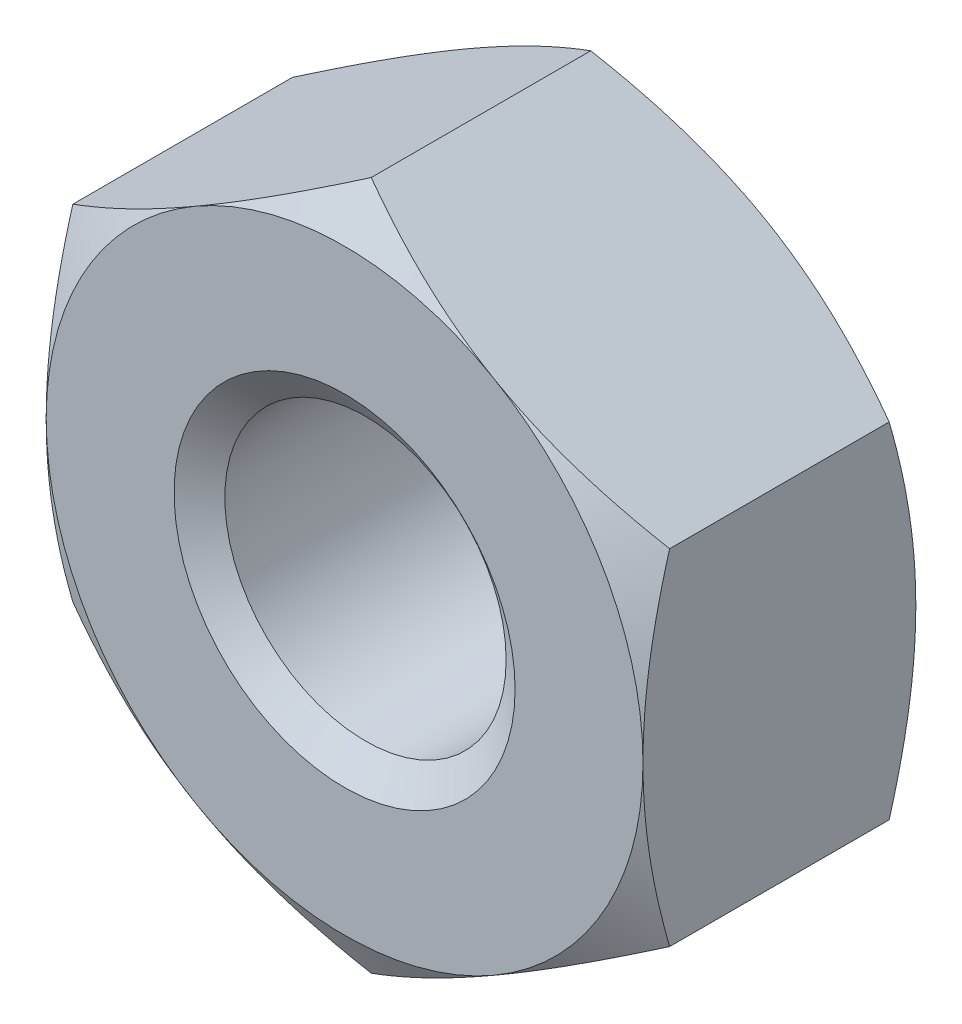
ISO-10303-21;
HEADER;
FILE_DESCRIPTION(('STEP AP214'),'2;1');
FILE_NAME('part.step','',(''),(''),'','','');
FILE_SCHEMA(('AUTOMOTIVE_DESIGN { 1 0 10303 214 1 1 1 1 }'));
ENDSEC;
DATA;
#1=APPLICATION_CONTEXT('core data for automotive mechanical design processes');
#2=APPLICATION_PROTOCOL_DEFINITION('international standard','automotive_design',2000,#1);
#3=PRODUCT_CONTEXT('',#1,'mechanical');
#4=PRODUCT('Part','Part','',(#3));
#5=PRODUCT_RELATED_PRODUCT_CATEGORY('part','',(#4));
#6=PRODUCT_DEFINITION_FORMATION('','',#4);
#7=PRODUCT_DEFINITION_CONTEXT('part definition',#1,'design');
#8=PRODUCT_DEFINITION('design','',#6,#7);
#9=PRODUCT_DEFINITION_SHAPE('','',#8);
#10=(LENGTH_UNIT() NAMED_UNIT(*) SI_UNIT(.MILLI.,.METRE.));
#11=(NAMED_UNIT(*) PLANE_ANGLE_UNIT() SI_UNIT($,.RADIAN.));
#12=(NAMED_UNIT(*) SI_UNIT($,.STERADIAN.) SOLID_ANGLE_UNIT());
#13=UNCERTAINTY_MEASURE_WITH_UNIT(LENGTH_MEASURE(1.E-05),#10,'distance_accuracy_value','');
#14=(GEOMETRIC_REPRESENTATION_CONTEXT(3) GLOBAL_UNCERTAINTY_ASSIGNED_CONTEXT((#13)) GLOBAL_UNIT_ASSIGNED_CONTEXT((#10,
#11,#12)) REPRESENTATION_CONTEXT('',''));
#15=CARTESIAN_POINT('',(0.,0.,0.));
#16=DIRECTION('',(0.,0.,1.));
#17=DIRECTION('',(1.,0.,0.));
#18=AXIS2_PLACEMENT_3D('',#15,#16,#17);
#19=CARTESIAN_POINT('',(0.,0.,-3.2));
#20=DIRECTION('',(0.,0.,1.));
#21=DIRECTION('',(1.,0.,0.));
#22=AXIS2_PLACEMENT_3D('',#19,#20,#21);
#23=CYLINDRICAL_SURFACE('',#22,1.65);
#24=CARTESIAN_POINT('',(0.,0.,-0.245072638373399));
#25=DIRECTION('',(0.,0.,1.));
#26=DIRECTION('',(1.,0.,0.));
#27=AXIS2_PLACEMENT_3D('',#24,#25,#26);
#28=CIRCLE('',#27,1.65);
#29=CARTESIAN_POINT('',(1.65,0.,-0.245072638373399));
#30=VERTEX_POINT('',#29);
#31=EDGE_CURVE('E185',#30,#30,#28,.F.);
#32=ORIENTED_EDGE('',*,*,#31,.F.);
#33=EDGE_LOOP('',(#32));
#34=FACE_BOUND('',#33,.T.);
#35=CARTESIAN_POINT('',(0.,0.,-2.9295273616266));
#36=DIRECTION('',(0.,0.,-1.));
#37=DIRECTION('',(-1.,0.,0.));
#38=AXIS2_PLACEMENT_3D('',#35,#36,#37);
#39=CIRCLE('',#38,1.65);
#40=CARTESIAN_POINT('',(-1.65,0.,-2.9295273616266));
#41=VERTEX_POINT('',#40);
#42=EDGE_CURVE('E44',#41,#41,#39,.F.);
#43=ORIENTED_EDGE('',*,*,#42,.F.);
#44=EDGE_LOOP('',(#43));
#45=FACE_BOUND('',#44,.T.);
#46=ADVANCED_FACE('F39',(#34,#45),#23,.F.);
#47=CARTESIAN_POINT('',(-6.99999999999999,0.,-3.2));
#48=DIRECTION('',(0.,0.,1.));
#49=DIRECTION('',(1.,0.,0.));
#50=AXIS2_PLACEMENT_3D('',#47,#48,#49);
#51=PLANE('',#50);
#52=CARTESIAN_POINT('',(0.,0.,-3.2));
#53=DIRECTION('',(0.,0.,1.));
#54=DIRECTION('',(1.,0.,0.));
#55=AXIS2_PLACEMENT_3D('',#52,#53,#54);
#56=CIRCLE('',#55,3.5);
#57=CARTESIAN_POINT('',(3.5,0.,-3.2));
#58=VERTEX_POINT('',#57);
#59=CARTESIAN_POINT('',(1.75,3.03108891324553,-3.2));
#60=VERTEX_POINT('',#59);
#61=EDGE_CURVE('E258',#58,#60,#56,.T.);
#62=ORIENTED_EDGE('',*,*,#61,.F.);
#63=CARTESIAN_POINT('',(0.,0.,-3.2));
#64=DIRECTION('',(0.,0.,1.));
#65=DIRECTION('',(1.,0.,0.));
#66=AXIS2_PLACEMENT_3D('',#63,#64,#65);
#67=CIRCLE('',#66,3.5);
#68=CARTESIAN_POINT('',(1.75,-3.03108891324553,-3.2));
#69=VERTEX_POINT('',#68);
#70=EDGE_CURVE('E179',#58,#69,#67,.F.);
#71=ORIENTED_EDGE('',*,*,#70,.T.);
#72=CARTESIAN_POINT('',(-1.75,-3.03108891324553,-3.2));
#73=VERTEX_POINT('',#72);
#74=EDGE_CURVE('E181',#69,#73,#67,.F.);
#75=ORIENTED_EDGE('',*,*,#74,.T.);
#76=CARTESIAN_POINT('',(-3.5,0.,-3.2));
#77=VERTEX_POINT('',#76);
#78=EDGE_CURVE('E417',#73,#77,#67,.F.);
#79=ORIENTED_EDGE('',*,*,#78,.T.);
#80=CARTESIAN_POINT('',(-1.75,3.03108891324553,-3.2));
#81=VERTEX_POINT('',#80);
#82=EDGE_CURVE('E419',#77,#81,#67,.F.);
#83=ORIENTED_EDGE('',*,*,#82,.T.);
#84=EDGE_CURVE('E163',#81,#60,#67,.F.);
#85=ORIENTED_EDGE('',*,*,#84,.T.);
#86=EDGE_LOOP('',(#62,#71,#75,#79,#83,#85));
#87=FACE_BOUND('',#86,.T.);
#88=CARTESIAN_POINT('',(0.,0.,-3.2));
#89=DIRECTION('',(0.,0.,1.));
#90=DIRECTION('',(1.,0.,0.));
#91=AXIS2_PLACEMENT_3D('',#88,#89,#90);
#92=CIRCLE('',#91,2.);
#93=CARTESIAN_POINT('',(2.,0.,-3.2));
#94=VERTEX_POINT('',#93);
#95=EDGE_CURVE('E189',#94,#94,#92,.F.);
#96=ORIENTED_EDGE('',*,*,#95,.F.);
#97=EDGE_LOOP('',(#96));
#98=FACE_BOUND('',#97,.T.);
#99=ADVANCED_FACE('F310',(#87,#98),#51,.F.);
#100=CARTESIAN_POINT('',(-6.99999999999999,0.,0.));
#101=DIRECTION('',(0.,0.,1.));
#102=DIRECTION('',(1.,0.,0.));
#103=AXIS2_PLACEMENT_3D('',#100,#101,#102);
#104=PLANE('',#103);
#105=CARTESIAN_POINT('',(0.,0.,0.));
#106=DIRECTION('',(0.,0.,1.));
#107=DIRECTION('',(1.,0.,0.));
#108=AXIS2_PLACEMENT_3D('',#105,#106,#107);
#109=CIRCLE('',#108,3.5);
#110=CARTESIAN_POINT('',(1.75,-3.03108891324553,0.));
#111=VERTEX_POINT('',#110);
#112=CARTESIAN_POINT('',(3.5,0.,0.));
#113=VERTEX_POINT('',#112);
#114=EDGE_CURVE('E52',#111,#113,#109,.T.);
#115=ORIENTED_EDGE('',*,*,#114,.T.);
#116=CARTESIAN_POINT('',(0.,0.,0.));
#117=DIRECTION('',(0.,0.,1.));
#118=DIRECTION('',(1.,0.,0.));
#119=AXIS2_PLACEMENT_3D('',#116,#117,#118);
#120=CIRCLE('',#119,3.5);
#121=CARTESIAN_POINT('',(1.75,3.03108891324553,0.));
#122=VERTEX_POINT('',#121);
#123=EDGE_CURVE('E59',#113,#122,#120,.T.);
#124=ORIENTED_EDGE('',*,*,#123,.T.);
#125=CARTESIAN_POINT('',(-1.75,3.03108891324553,0.));
#126=VERTEX_POINT('',#125);
#127=EDGE_CURVE('E11',#122,#126,#109,.T.);
#128=ORIENTED_EDGE('',*,*,#127,.T.);
#129=CARTESIAN_POINT('',(-3.5,0.,0.));
#130=VERTEX_POINT('',#129);
#131=EDGE_CURVE('E50',#126,#130,#109,.T.);
#132=ORIENTED_EDGE('',*,*,#131,.T.);
#133=CARTESIAN_POINT('',(-1.75,-3.03108891324553,0.));
#134=VERTEX_POINT('',#133);
#135=EDGE_CURVE('E361',#130,#134,#109,.T.);
#136=ORIENTED_EDGE('',*,*,#135,.T.);
#137=EDGE_CURVE('E184',#134,#111,#109,.T.);
#138=ORIENTED_EDGE('',*,*,#137,.T.);
#139=EDGE_LOOP('',(#115,#124,#128,#132,#136,#138));
#140=FACE_BOUND('',#139,.T.);
#141=CARTESIAN_POINT('',(0.,0.,0.));
#142=DIRECTION('',(0.,0.,1.));
#143=DIRECTION('',(1.,0.,0.));
#144=AXIS2_PLACEMENT_3D('',#141,#142,#143);
#145=CIRCLE('',#144,2.);
#146=CARTESIAN_POINT('',(2.,0.,0.));
#147=VERTEX_POINT('',#146);
#148=EDGE_CURVE('E188',#147,#147,#145,.T.);
#149=ORIENTED_EDGE('',*,*,#148,.F.);
#150=EDGE_LOOP('',(#149));
#151=FACE_BOUND('',#150,.T.);
#152=ADVANCED_FACE('F263',(#140,#151),#104,.T.);
#153=CARTESIAN_POINT('',(0.,4.04145188432738,-3.2));
#154=DIRECTION('',(-0.500000000000001,0.866025403784438,0.));
#155=DIRECTION('',(-0.866025403784438,-0.500000000000001,0.));
#156=AXIS2_PLACEMENT_3D('',#153,#154,#155);
#157=PLANE('',#156);
#158=DIRECTION('',(0.,0.,1.));
#159=VECTOR('',#158,1.);
#160=CARTESIAN_POINT('',(-3.5,2.02072594216369,-3.2));
#161=LINE('',#160,#159);
#162=CARTESIAN_POINT('',(-3.5,2.0207259421637,-2.88739260883035));
#163=VERTEX_POINT('',#162);
#164=CARTESIAN_POINT('',(-3.5,2.02072594216369,-0.312607391169644));
#165=VERTEX_POINT('',#164);
#166=EDGE_CURVE('E175',#163,#165,#161,.T.);
#167=ORIENTED_EDGE('',*,*,#166,.T.);
#168=CARTESIAN_POINT('',(-3.5002,2.02061047210985,-0.312674060693372));
#169=CARTESIAN_POINT('',(-3.34639282154755,2.10941108799267,-0.261385788989984));
#170=CARTESIAN_POINT('',(-3.19125798916558,2.19897822522909,-0.214740953816197));
#171=CARTESIAN_POINT('',(-2.87830199342322,2.37966345361545,-0.133321875533348));
#172=CARTESIAN_POINT('',(-2.7204752692125,2.47078475532382,-0.0985764355845611));
#173=CARTESIAN_POINT('',(-2.40677778961987,2.65189807961073,-0.0444900271828357));
#174=CARTESIAN_POINT('',(-2.25095530083931,2.74186223545399,-0.0247890862603813));
#175=CARTESIAN_POINT('',(-1.93857711279463,2.92221386641056,-0.00127013273725425));
#176=CARTESIAN_POINT('',(-1.78202254896577,3.01260068598001,0.00256735545443477));
#177=CARTESIAN_POINT('',(-1.48949078007901,3.1814939814933,-0.00541530187697793));
#178=CARTESIAN_POINT('',(-1.35346978754209,3.26002573814993,-0.0152754340696075));
#179=CARTESIAN_POINT('',(-1.08231397971101,3.41657761679354,-0.0465264668994044));
#180=CARTESIAN_POINT('',(-0.947180102315318,3.49459719728458,-0.0679280432857993));
#181=CARTESIAN_POINT('',(-0.675465207594817,3.65147186489429,-0.121430407880579));
#182=CARTESIAN_POINT('',(-0.538918580721665,3.73030709667644,-0.153757994445089));
#183=CARTESIAN_POINT('',(-0.267861907055499,3.88680174018324,-0.227128933807997));
#184=CARTESIAN_POINT('',(-0.133348387531464,3.96446315689009,-0.26815504656987));
#185=CARTESIAN_POINT('',(0.000199999999999316,4.04156735438122,-0.312674060693374));
#186=B_SPLINE_CURVE_WITH_KNOTS('',3,(#168,#169,#170,#171,#172,#173,#174,#175,#176,#177,#178,
#179,#180,#181,#182,#183,#184,#185),.UNSPECIFIED.,.F.,.F.,(4,2,2,2,2,2,2,2,4),(0.,
0.554793832886255,1.11092123814984,1.65328467083219,2.19498204478403,2.6666513085086,
3.13875761298267,3.6213361260051,4.10296698719187),.UNSPECIFIED.);
#187=EDGE_CURVE('E67',#165,#126,#186,.T.);
#188=ORIENTED_EDGE('',*,*,#187,.T.);
#189=CARTESIAN_POINT('',(0.,4.04145188432738,-0.312607391169646));
#190=VERTEX_POINT('',#189);
#191=EDGE_CURVE('E252',#126,#190,#186,.T.);
#192=ORIENTED_EDGE('',*,*,#191,.T.);
#193=DIRECTION('',(0.,0.,1.));
#194=VECTOR('',#193,1.);
#195=CARTESIAN_POINT('',(0.,4.04145188432738,-3.2));
#196=LINE('',#195,#194);
#197=CARTESIAN_POINT('',(0.,4.04145188432738,-2.88739260883035));
#198=VERTEX_POINT('',#197);
#199=EDGE_CURVE('E159',#198,#190,#196,.T.);
#200=ORIENTED_EDGE('',*,*,#199,.F.);
#201=CARTESIAN_POINT('',(-3.5002,2.02061047210985,-2.88732593930663));
#202=CARTESIAN_POINT('',(-3.34639282154755,2.10941108799267,-2.93861421101002));
#203=CARTESIAN_POINT('',(-3.19125798916558,2.19897822522909,-2.9852590461838));
#204=CARTESIAN_POINT('',(-2.87830199342322,2.37966345361545,-3.06667812446665));
#205=CARTESIAN_POINT('',(-2.7204752692125,2.47078475532382,-3.10142356441544));
#206=CARTESIAN_POINT('',(-2.40677778961987,2.65189807961073,-3.15550997281716));
#207=CARTESIAN_POINT('',(-2.25095530083931,2.74186223545399,-3.17521091373962));
#208=CARTESIAN_POINT('',(-1.93857711279463,2.92221386641056,-3.19872986726275));
#209=CARTESIAN_POINT('',(-1.78202254896577,3.01260068598001,-3.20256735545443));
#210=CARTESIAN_POINT('',(-1.48949078007901,3.1814939814933,-3.19458469812302));
#211=CARTESIAN_POINT('',(-1.35346978754209,3.26002573814993,-3.18472456593039));
#212=CARTESIAN_POINT('',(-1.08231397971101,3.41657761679354,-3.1534735331006));
#213=CARTESIAN_POINT('',(-0.947180102315318,3.49459719728458,-3.1320719567142));
#214=CARTESIAN_POINT('',(-0.675465207594817,3.65147186489429,-3.07856959211942));
#215=CARTESIAN_POINT('',(-0.538918580721665,3.73030709667644,-3.04624200555491));
#216=CARTESIAN_POINT('',(-0.267861907055499,3.88680174018324,-2.972871066192));
#217=CARTESIAN_POINT('',(-0.133348387531464,3.96446315689009,-2.93184495343013));
#218=CARTESIAN_POINT('',(0.000199999999999315,4.04156735438122,-2.88732593930663));
#219=B_SPLINE_CURVE_WITH_KNOTS('',3,(#201,#202,#203,#204,#205,#206,#207,#208,#209,#210,#211,
#212,#213,#214,#215,#216,#217,#218),.UNSPECIFIED.,.F.,.F.,(4,2,2,2,2,2,2,2,4),(0.,
0.554793832886255,1.11092123814984,1.65328467083219,2.19498204478403,2.6666513085086,
3.13875761298267,3.6213361260051,4.10296698719187),.UNSPECIFIED.);
#220=EDGE_CURVE('E178',#81,#198,#219,.T.);
#221=ORIENTED_EDGE('',*,*,#220,.F.);
#222=EDGE_CURVE('E273',#163,#81,#219,.T.);
#223=ORIENTED_EDGE('',*,*,#222,.F.);
#224=EDGE_LOOP('',(#167,#188,#192,#200,#221,#223));
#225=FACE_BOUND('',#224,.T.);
#226=ADVANCED_FACE('F41',(#225),#157,.T.);
#227=CARTESIAN_POINT('',(3.5,2.02072594216369,-3.2));
#228=DIRECTION('',(0.500000000000001,0.866025403784438,0.));
#229=DIRECTION('',(-0.866025403784438,0.500000000000001,0.));
#230=AXIS2_PLACEMENT_3D('',#227,#228,#229);
#231=PLANE('',#230);
#232=ORIENTED_EDGE('',*,*,#199,.T.);
#233=CARTESIAN_POINT('',(-0.000200000000000704,4.04156735438122,-0.312674060693374));
#234=CARTESIAN_POINT('',(0.153607178452449,3.9527667384984,-0.261385788989987));
#235=CARTESIAN_POINT('',(0.308742010834424,3.86319960126198,-0.2147409538162));
#236=CARTESIAN_POINT('',(0.621698006576781,3.68251437287562,-0.133321875533351));
#237=CARTESIAN_POINT('',(0.779524730787496,3.59139307116725,-0.098576435584563));
#238=CARTESIAN_POINT('',(1.09322221038013,3.41027974688034,-0.0444900271828369));
#239=CARTESIAN_POINT('',(1.24904469916069,3.32031559103708,-0.0247890862603821));
#240=CARTESIAN_POINT('',(1.56142288720537,3.13996396008052,-0.00127013273725462));
#241=CARTESIAN_POINT('',(1.71797745103423,3.04957714051106,0.00256735545443461));
#242=CARTESIAN_POINT('',(2.01050921992099,2.88068384499777,-0.0054153018769778));
#243=CARTESIAN_POINT('',(2.14653021245791,2.80215208834114,-0.0152754340696073));
#244=CARTESIAN_POINT('',(2.417686020289,2.64560020969753,-0.0465264668994037));
#245=CARTESIAN_POINT('',(2.55281989768468,2.56758062920649,-0.0679280432857983));
#246=CARTESIAN_POINT('',(2.82453479240518,2.41070596159678,-0.121430407880577));
#247=CARTESIAN_POINT('',(2.96108141927834,2.33187072981463,-0.153757994445087));
#248=CARTESIAN_POINT('',(3.2321380929445,2.17537608630783,-0.227128933807995));
#249=CARTESIAN_POINT('',(3.36665161246854,2.09771466960098,-0.268155046569868));
#250=CARTESIAN_POINT('',(3.5002,2.02061047210985,-0.312674060693372));
#251=B_SPLINE_CURVE_WITH_KNOTS('',3,(#233,#234,#235,#236,#237,#238,#239,#240,#241,#242,#243,
#244,#245,#246,#247,#248,#249,#250),.UNSPECIFIED.,.F.,.F.,(4,2,2,2,2,2,2,2,4),(0.,
0.554793832886255,1.11092123814984,1.65328467083219,2.19498204478403,2.6666513085086,
3.13875761298268,3.6213361260051,4.10296698719188),.UNSPECIFIED.);
#252=EDGE_CURVE('E151',#190,#122,#251,.T.);
#253=ORIENTED_EDGE('',*,*,#252,.T.);
#254=CARTESIAN_POINT('',(3.5,2.0207259421637,-0.312607391169646));
#255=VERTEX_POINT('',#254);
#256=EDGE_CURVE('E137',#122,#255,#251,.T.);
#257=ORIENTED_EDGE('',*,*,#256,.T.);
#258=DIRECTION('',(0.,0.,1.));
#259=VECTOR('',#258,1.);
#260=CARTESIAN_POINT('',(3.5,2.02072594216369,-3.2));
#261=LINE('',#260,#259);
#262=CARTESIAN_POINT('',(3.5,2.0207259421637,-2.88739260883035));
#263=VERTEX_POINT('',#262);
#264=EDGE_CURVE('E150',#263,#255,#261,.T.);
#265=ORIENTED_EDGE('',*,*,#264,.F.);
#266=CARTESIAN_POINT('',(-0.000200000000000676,4.04156735438122,-2.88732593930663));
#267=CARTESIAN_POINT('',(0.153607178452449,3.9527667384984,-2.93861421101001));
#268=CARTESIAN_POINT('',(0.308742010834423,3.86319960126198,-2.9852590461838));
#269=CARTESIAN_POINT('',(0.621698006576781,3.68251437287562,-3.06667812446665));
#270=CARTESIAN_POINT('',(0.779524730787496,3.59139307116725,-3.10142356441544));
#271=CARTESIAN_POINT('',(1.09322221038013,3.41027974688034,-3.15550997281716));
#272=CARTESIAN_POINT('',(1.24904469916069,3.32031559103708,-3.17521091373962));
#273=CARTESIAN_POINT('',(1.56142288720537,3.13996396008052,-3.19872986726275));
#274=CARTESIAN_POINT('',(1.71797745103423,3.04957714051106,-3.20256735545444));
#275=CARTESIAN_POINT('',(2.01050921992099,2.88068384499777,-3.19458469812302));
#276=CARTESIAN_POINT('',(2.14653021245791,2.80215208834114,-3.18472456593039));
#277=CARTESIAN_POINT('',(2.417686020289,2.64560020969753,-3.1534735331006));
#278=CARTESIAN_POINT('',(2.55281989768468,2.56758062920649,-3.1320719567142));
#279=CARTESIAN_POINT('',(2.82453479240518,2.41070596159678,-3.07856959211942));
#280=CARTESIAN_POINT('',(2.96108141927834,2.33187072981463,-3.04624200555491));
#281=CARTESIAN_POINT('',(3.2321380929445,2.17537608630783,-2.97287106619201));
#282=CARTESIAN_POINT('',(3.36665161246854,2.09771466960098,-2.93184495343013));
#283=CARTESIAN_POINT('',(3.5002,2.02061047210985,-2.88732593930663));
#284=B_SPLINE_CURVE_WITH_KNOTS('',3,(#266,#267,#268,#269,#270,#271,#272,#273,#274,#275,#276,
#277,#278,#279,#280,#281,#282,#283),.UNSPECIFIED.,.F.,.F.,(4,2,2,2,2,2,2,2,4),(0.,
0.554793832886254,1.11092123814984,1.65328467083219,2.19498204478403,2.6666513085086,
3.13875761298268,3.6213361260051,4.10296698719188),.UNSPECIFIED.);
#285=EDGE_CURVE('E267',#60,#263,#284,.T.);
#286=ORIENTED_EDGE('',*,*,#285,.F.);
#287=EDGE_CURVE('E272',#198,#60,#284,.T.);
#288=ORIENTED_EDGE('',*,*,#287,.F.);
#289=EDGE_LOOP('',(#232,#253,#257,#265,#286,#288));
#290=FACE_BOUND('',#289,.T.);
#291=ADVANCED_FACE('F148',(#290),#231,.T.);
#292=CARTESIAN_POINT('',(3.5,2.02072594216369,-3.2));
#293=DIRECTION('',(-1.,0.,0.));
#294=DIRECTION('',(0.,0.,1.));
#295=AXIS2_PLACEMENT_3D('',#292,#293,#294);
#296=PLANE('',#295);
#297=CARTESIAN_POINT('',(3.5,-5.35926299121406,-1.67484346858557));
#298=CARTESIAN_POINT('',(3.5,-5.20559319908842,-1.60058173692104));
#299=CARTESIAN_POINT('',(3.5,-5.05156008083376,-1.52705822833148));
#300=CARTESIAN_POINT('',(3.5,-4.74257074180711,-1.38190950344752));
#301=CARTESIAN_POINT('',(3.5,-4.58761436682437,-1.31028461582133));
#302=CARTESIAN_POINT('',(3.5,-4.27574500225543,-1.16897765517624));
#303=CARTESIAN_POINT('',(3.5,-4.11882589028192,-1.09930904568016));
#304=CARTESIAN_POINT('',(3.5,-3.80369792903856,-0.962964262242765));
#305=CARTESIAN_POINT('',(3.5,-3.64548914750596,-0.896287932319522));
#306=CARTESIAN_POINT('',(3.5,-3.32556618401856,-0.765931819095071));
#307=CARTESIAN_POINT('',(3.5,-3.16383281219924,-0.702298873688869));
#308=CARTESIAN_POINT('',(3.5,-2.83845840945598,-0.580016702089496));
#309=CARTESIAN_POINT('',(3.5,-2.67481716858826,-0.521368030370695));
#310=CARTESIAN_POINT('',(3.5,-2.3457027847205,-0.410630279877024));
#311=CARTESIAN_POINT('',(3.5,-2.18023438248743,-0.35852725543586));
#312=CARTESIAN_POINT('',(3.5,-1.8469452280637,-0.262572936976445));
#313=CARTESIAN_POINT('',(3.5,-1.6791252378753,-0.218719033467159));
#314=CARTESIAN_POINT('',(3.5,-1.34101828610925,-0.141391945584788));
#315=CARTESIAN_POINT('',(3.5,-1.17073068027694,-0.107921525211973));
#316=CARTESIAN_POINT('',(3.5,-0.828102385138486,-0.0536149564320509));
#317=CARTESIAN_POINT('',(3.5,-0.655761694017303,-0.0327788191952369));
#318=CARTESIAN_POINT('',(3.5,-0.311020490924451,-0.00558408650575712));
#319=CARTESIAN_POINT('',(3.5,-0.138627397207261,0.000866163165910796));
#320=CARTESIAN_POINT('',(3.5,0.206038074906534,-0.0010535580779465));
#321=CARTESIAN_POINT('',(3.5,0.378310473023179,-0.00941968196343218));
#322=CARTESIAN_POINT('',(3.5,0.672490555822326,-0.0357688927868923));
#323=CARTESIAN_POINT('',(3.5,0.79472279108409,-0.0503206340384215));
#324=CARTESIAN_POINT('',(3.5,1.0382430543056,-0.0859367340533558));
#325=CARTESIAN_POINT('',(3.5,1.15953093025886,-0.107002119926141));
#326=CARTESIAN_POINT('',(3.5,1.52187914771348,-0.178863187081452));
#327=CARTESIAN_POINT('',(3.5,1.76124104212631,-0.23830527562201));
#328=CARTESIAN_POINT('',(3.5,2.11940971387708,-0.340826814402554));
#329=CARTESIAN_POINT('',(3.5,2.24008344316346,-0.377749699085182));
#330=CARTESIAN_POINT('',(3.5,2.48017139213728,-0.455249007699292));
#331=CARTESIAN_POINT('',(3.5,2.59958641795612,-0.495822911663549));
#332=CARTESIAN_POINT('',(3.5,2.83665760451798,-0.579779986782751));
#333=CARTESIAN_POINT('',(3.5,2.95431988203483,-0.623146060034313));
#334=CARTESIAN_POINT('',(3.5,3.18873153508799,-0.712423559566865));
#335=CARTESIAN_POINT('',(3.5,3.30548051959463,-0.758336014592948));
#336=CARTESIAN_POINT('',(3.5,3.42180736613348,-0.805270380724069));
#337=B_SPLINE_CURVE_WITH_KNOTS('',3,(#297,#298,#299,#300,#301,#302,#303,#304,#305,#306,#307,
#308,#309,#310,#311,#312,#313,#314,#315,#316,#317,#318,#319,#320,#321,#322,#323,#324,#325,#326,
#327,#328,#329,#330,#331,#332,#333,#334,#335,#336),.UNSPECIFIED.,.F.,.F.,(4,2,2,2,2,2,2,2,2,2,2,
2,2,2,2,2,2,2,2,4),(0.,0.512025318465737,1.02413870177436,1.53918270315241,2.05419982499223,
2.57553975872798,3.09693761309353,3.617205066104,4.13730766217537,4.65754858684365,
5.17778997146961,5.69470725122282,6.21149033452401,6.58059623222331,6.94976036239485,
7.68863804939851,8.06719621660478,8.4454950747676,8.82166461280099,9.1979872473341),.UNSPECIFIED.);
#338=CARTESIAN_POINT('',(3.5,-2.0207259421637,-0.312607391169646));
#339=VERTEX_POINT('',#338);
#340=EDGE_CURVE('E143',#339,#113,#337,.T.);
#341=ORIENTED_EDGE('',*,*,#340,.F.);
#342=DIRECTION('',(0.,0.,1.));
#343=VECTOR('',#342,1.);
#344=CARTESIAN_POINT('',(3.5,-2.0207259421637,-3.2));
#345=LINE('',#344,#343);
#346=CARTESIAN_POINT('',(3.5,-2.0207259421637,-2.88739260883035));
#347=VERTEX_POINT('',#346);
#348=EDGE_CURVE('E160',#347,#339,#345,.T.);
#349=ORIENTED_EDGE('',*,*,#348,.F.);
#350=CARTESIAN_POINT('',(3.5,-5.35926299121406,-1.52515653141443));
#351=CARTESIAN_POINT('',(3.5,-5.20559319908842,-1.59941826307896));
#352=CARTESIAN_POINT('',(3.5,-5.05156008083376,-1.67294177166852));
#353=CARTESIAN_POINT('',(3.5,-4.74257074180711,-1.81809049655248));
#354=CARTESIAN_POINT('',(3.5,-4.58761436682437,-1.88971538417867));
#355=CARTESIAN_POINT('',(3.5,-4.27574500225542,-2.03102234482376));
#356=CARTESIAN_POINT('',(3.5,-4.11882589028192,-2.10069095431984));
#357=CARTESIAN_POINT('',(3.5,-3.80369792903856,-2.23703573775724));
#358=CARTESIAN_POINT('',(3.5,-3.64548914750596,-2.30371206768048));
#359=CARTESIAN_POINT('',(3.5,-3.32556618401856,-2.43406818090493));
#360=CARTESIAN_POINT('',(3.5,-3.16383281219924,-2.49770112631113));
#361=CARTESIAN_POINT('',(3.5,-2.83845840945598,-2.6199832979105));
#362=CARTESIAN_POINT('',(3.5,-2.67481716858826,-2.67863196962931));
#363=CARTESIAN_POINT('',(3.5,-2.34570278472049,-2.78936972012298));
#364=CARTESIAN_POINT('',(3.5,-2.18023438248743,-2.84147274456414));
#365=CARTESIAN_POINT('',(3.5,-1.8469452280637,-2.93742706302356));
#366=CARTESIAN_POINT('',(3.5,-1.6791252378753,-2.98128096653284));
#367=CARTESIAN_POINT('',(3.5,-1.34101828610925,-3.05860805441521));
#368=CARTESIAN_POINT('',(3.5,-1.17073068027694,-3.09207847478803));
#369=CARTESIAN_POINT('',(3.5,-0.828102385138486,-3.14638504356795));
#370=CARTESIAN_POINT('',(3.5,-0.655761694017304,-3.16722118080476));
#371=CARTESIAN_POINT('',(3.5,-0.311020490924451,-3.19441591349424));
#372=CARTESIAN_POINT('',(3.5,-0.138627397207261,-3.20086616316591));
#373=CARTESIAN_POINT('',(3.5,0.206038074906534,-3.19894644192205));
#374=CARTESIAN_POINT('',(3.5,0.378310473023179,-3.19058031803657));
#375=CARTESIAN_POINT('',(3.5,0.672490555822326,-3.16423110721311));
#376=CARTESIAN_POINT('',(3.5,0.794722791084091,-3.14967936596158));
#377=CARTESIAN_POINT('',(3.5,1.0382430543056,-3.11406326594664));
#378=CARTESIAN_POINT('',(3.5,1.15953093025886,-3.09299788007386));
#379=CARTESIAN_POINT('',(3.5,1.52187914771348,-3.02113681291855));
#380=CARTESIAN_POINT('',(3.5,1.76124104212632,-2.96169472437799));
#381=CARTESIAN_POINT('',(3.5,2.11940971387708,-2.85917318559745));
#382=CARTESIAN_POINT('',(3.5,2.24008344316346,-2.82225030091482));
#383=CARTESIAN_POINT('',(3.5,2.48017139213728,-2.74475099230071));
#384=CARTESIAN_POINT('',(3.5,2.59958641795612,-2.70417708833645));
#385=CARTESIAN_POINT('',(3.5,2.83665760451798,-2.62022001321725));
#386=CARTESIAN_POINT('',(3.5,2.95431988203483,-2.57685393996569));
#387=CARTESIAN_POINT('',(3.5,3.18873153508799,-2.48757644043314));
#388=CARTESIAN_POINT('',(3.5,3.30548051959463,-2.44166398540705));
#389=CARTESIAN_POINT('',(3.5,3.42180736613348,-2.39472961927593));
#390=B_SPLINE_CURVE_WITH_KNOTS('',3,(#350,#351,#352,#353,#354,#355,#356,#357,#358,#359,#360,
#361,#362,#363,#364,#365,#366,#367,#368,#369,#370,#371,#372,#373,#374,#375,#376,#377,#378,#379,
#380,#381,#382,#383,#384,#385,#386,#387,#388,#389),.UNSPECIFIED.,.F.,.F.,(4,2,2,2,2,2,2,2,2,2,2,
2,2,2,2,2,2,2,2,4),(0.,0.512025318465738,1.02413870177436,1.53918270315241,2.05419982499224,
2.57553975872798,3.09693761309353,3.61720506610401,4.13730766217537,4.65754858684365,
5.17778997146961,5.69470725122282,6.21149033452401,6.58059623222331,6.94976036239485,
7.68863804939851,8.06719621660478,8.4454950747676,8.82166461280099,9.1979872473341),.UNSPECIFIED.);
#391=EDGE_CURVE('E278',#347,#58,#390,.T.);
#392=ORIENTED_EDGE('',*,*,#391,.T.);
#393=EDGE_CURVE('E158',#58,#263,#390,.T.);
#394=ORIENTED_EDGE('',*,*,#393,.T.);
#395=ORIENTED_EDGE('',*,*,#264,.T.);
#396=EDGE_CURVE('E134',#113,#255,#337,.T.);
#397=ORIENTED_EDGE('',*,*,#396,.F.);
#398=EDGE_LOOP('',(#341,#349,#392,#394,#395,#397));
#399=FACE_BOUND('',#398,.T.);
#400=ADVANCED_FACE('F155',(#399),#296,.F.);
#401=CARTESIAN_POINT('',(0.,-4.04145188432739,-3.2));
#402=DIRECTION('',(0.500000000000001,-0.866025403784438,0.));
#403=DIRECTION('',(0.866025403784438,0.500000000000001,0.));
#404=AXIS2_PLACEMENT_3D('',#401,#402,#403);
#405=PLANE('',#404);
#406=ORIENTED_EDGE('',*,*,#348,.T.);
#407=CARTESIAN_POINT('',(3.5002,-2.02061047210986,-0.312674060693374));
#408=CARTESIAN_POINT('',(3.34639282154755,-2.10941108799268,-0.261385788989986));
#409=CARTESIAN_POINT('',(3.19125798916558,-2.1989782252291,-0.2147409538162));
#410=CARTESIAN_POINT('',(2.87830199342322,-2.37966345361546,-0.133321875533352));
#411=CARTESIAN_POINT('',(2.7204752692125,-2.47078475532383,-0.0985764355845647));
#412=CARTESIAN_POINT('',(2.40677778961987,-2.65189807961074,-0.0444900271828395));
#413=CARTESIAN_POINT('',(2.25095530083931,-2.741862235454,-0.0247890862603848));
#414=CARTESIAN_POINT('',(1.93857711279462,-2.92221386641056,-0.00127013273725795));
#415=CARTESIAN_POINT('',(1.78202254896577,-3.01260068598002,0.00256735545443071));
#416=CARTESIAN_POINT('',(1.48949078007901,-3.18149398149331,-0.00541530187698259));
#417=CARTESIAN_POINT('',(1.35346978754209,-3.26002573814994,-0.0152754340696124));
#418=CARTESIAN_POINT('',(1.082313979711,-3.41657761679355,-0.0465264668994095));
#419=CARTESIAN_POINT('',(0.947180102315316,-3.49459719728459,-0.0679280432858045));
#420=CARTESIAN_POINT('',(0.675465207594815,-3.6514718648943,-0.121430407880584));
#421=CARTESIAN_POINT('',(0.538918580721664,-3.73030709667645,-0.153757994445094));
#422=CARTESIAN_POINT('',(0.267861907055498,-3.88680174018325,-0.227128933808002));
#423=CARTESIAN_POINT('',(0.133348387531464,-3.9644631568901,-0.268155046569875));
#424=CARTESIAN_POINT('',(-0.000199999999999812,-4.04156735438123,-0.312674060693379));
#425=B_SPLINE_CURVE_WITH_KNOTS('',3,(#407,#408,#409,#410,#411,#412,#413,#414,#415,#416,#417,
#418,#419,#420,#421,#422,#423,#424),.UNSPECIFIED.,.F.,.F.,(4,2,2,2,2,2,2,2,4),(0.,
0.554793832886254,1.11092123814984,1.65328467083219,2.19498204478403,2.6666513085086,
3.13875761298268,3.6213361260051,4.10296698719187),.UNSPECIFIED.);
#426=EDGE_CURVE('E349',#339,#111,#425,.T.);
#427=ORIENTED_EDGE('',*,*,#426,.T.);
#428=CARTESIAN_POINT('',(0.,-4.04145188432738,-0.312607391169646));
#429=VERTEX_POINT('',#428);
#430=EDGE_CURVE('E239',#111,#429,#425,.T.);
#431=ORIENTED_EDGE('',*,*,#430,.T.);
#432=DIRECTION('',(0.,0.,1.));
#433=VECTOR('',#432,1.);
#434=CARTESIAN_POINT('',(0.,-4.04145188432739,-3.2));
#435=LINE('',#434,#433);
#436=CARTESIAN_POINT('',(0.,-4.04145188432738,-2.88739260883035));
#437=VERTEX_POINT('',#436);
#438=EDGE_CURVE('E166',#437,#429,#435,.T.);
#439=ORIENTED_EDGE('',*,*,#438,.F.);
#440=CARTESIAN_POINT('',(3.5002,-2.02061047210986,-2.88732593930663));
#441=CARTESIAN_POINT('',(3.34639282154755,-2.10941108799268,-2.93861421101001));
#442=CARTESIAN_POINT('',(3.19125798916558,-2.1989782252291,-2.9852590461838));
#443=CARTESIAN_POINT('',(2.87830199342322,-2.37966345361546,-3.06667812446665));
#444=CARTESIAN_POINT('',(2.7204752692125,-2.47078475532383,-3.10142356441544));
#445=CARTESIAN_POINT('',(2.40677778961987,-2.65189807961074,-3.15550997281716));
#446=CARTESIAN_POINT('',(2.25095530083931,-2.741862235454,-3.17521091373961));
#447=CARTESIAN_POINT('',(1.93857711279462,-2.92221386641056,-3.19872986726274));
#448=CARTESIAN_POINT('',(1.78202254896577,-3.01260068598002,-3.20256735545443));
#449=CARTESIAN_POINT('',(1.48949078007901,-3.18149398149331,-3.19458469812302));
#450=CARTESIAN_POINT('',(1.35346978754209,-3.26002573814994,-3.18472456593039));
#451=CARTESIAN_POINT('',(1.082313979711,-3.41657761679355,-3.15347353310059));
#452=CARTESIAN_POINT('',(0.947180102315316,-3.49459719728459,-3.1320719567142));
#453=CARTESIAN_POINT('',(0.675465207594815,-3.6514718648943,-3.07856959211942));
#454=CARTESIAN_POINT('',(0.538918580721663,-3.73030709667645,-3.04624200555491));
#455=CARTESIAN_POINT('',(0.267861907055498,-3.88680174018325,-2.972871066192));
#456=CARTESIAN_POINT('',(0.133348387531463,-3.9644631568901,-2.93184495343012));
#457=CARTESIAN_POINT('',(-0.000199999999999699,-4.04156735438123,-2.88732593930662));
#458=B_SPLINE_CURVE_WITH_KNOTS('',3,(#440,#441,#442,#443,#444,#445,#446,#447,#448,#449,#450,
#451,#452,#453,#454,#455,#456,#457),.UNSPECIFIED.,.F.,.F.,(4,2,2,2,2,2,2,2,4),(0.,
0.554793832886255,1.11092123814984,1.65328467083219,2.19498204478403,2.6666513085086,
3.13875761298268,3.6213361260051,4.10296698719187),.UNSPECIFIED.);
#459=EDGE_CURVE('E284',#69,#437,#458,.T.);
#460=ORIENTED_EDGE('',*,*,#459,.F.);
#461=EDGE_CURVE('E283',#347,#69,#458,.T.);
#462=ORIENTED_EDGE('',*,*,#461,.F.);
#463=EDGE_LOOP('',(#406,#427,#431,#439,#460,#462));
#464=FACE_BOUND('',#463,.T.);
#465=ADVANCED_FACE('F294',(#464),#405,.T.);
#466=CARTESIAN_POINT('',(-3.5,-2.0207259421637,-3.2));
#467=DIRECTION('',(-0.500000000000001,-0.866025403784438,0.));
#468=DIRECTION('',(0.866025403784438,-0.500000000000001,0.));
#469=AXIS2_PLACEMENT_3D('',#466,#467,#468);
#470=PLANE('',#469);
#471=ORIENTED_EDGE('',*,*,#438,.T.);
#472=CARTESIAN_POINT('',(0.000200000000000215,-4.04156735438123,-0.31267406069338));
#473=CARTESIAN_POINT('',(-0.15360717845245,-3.95276673849841,-0.261385788989992));
#474=CARTESIAN_POINT('',(-0.308742010834425,-3.86319960126199,-0.214740953816205));
#475=CARTESIAN_POINT('',(-0.621698006576783,-3.68251437287563,-0.133321875533355));
#476=CARTESIAN_POINT('',(-0.779524730787498,-3.59139307116726,-0.0985764355845674));
#477=CARTESIAN_POINT('',(-1.09322221038013,-3.41027974688034,-0.0444900271828413));
#478=CARTESIAN_POINT('',(-1.2490446991607,-3.32031559103709,-0.0247890862603864));
#479=CARTESIAN_POINT('',(-1.56142288720538,-3.13996396008052,-0.00127013273725881));
#480=CARTESIAN_POINT('',(-1.71797745103424,-3.04957714051107,0.00256735545443048));
#481=CARTESIAN_POINT('',(-2.01050921992099,-2.88068384499778,-0.00541530187698203));
#482=CARTESIAN_POINT('',(-2.14653021245791,-2.80215208834115,-0.0152754340696116));
#483=CARTESIAN_POINT('',(-2.417686020289,-2.64560020969754,-0.0465264668994079));
#484=CARTESIAN_POINT('',(-2.55281989768469,-2.5675806292065,-0.0679280432858023));
#485=CARTESIAN_POINT('',(-2.82453479240519,-2.41070596159679,-0.121430407880581));
#486=CARTESIAN_POINT('',(-2.96108141927834,-2.33187072981464,-0.153757994445091));
#487=CARTESIAN_POINT('',(-3.2321380929445,-2.17537608630784,-0.227128933807998));
#488=CARTESIAN_POINT('',(-3.36665161246854,-2.09771466960099,-0.26815504656987));
#489=CARTESIAN_POINT('',(-3.5002,-2.02061047210986,-0.312674060693374));
#490=B_SPLINE_CURVE_WITH_KNOTS('',3,(#472,#473,#474,#475,#476,#477,#478,#479,#480,#481,#482,
#483,#484,#485,#486,#487,#488,#489),.UNSPECIFIED.,.F.,.F.,(4,2,2,2,2,2,2,2,4),(0.,
0.554793832886256,1.11092123814984,1.65328467083219,2.19498204478404,2.66665130850861,
3.13875761298268,3.6213361260051,4.10296698719187),.UNSPECIFIED.);
#491=EDGE_CURVE('E352',#429,#134,#490,.T.);
#492=ORIENTED_EDGE('',*,*,#491,.T.);
#493=CARTESIAN_POINT('',(-3.5,-2.0207259421637,-0.312607391169646));
#494=VERTEX_POINT('',#493);
#495=EDGE_CURVE('E212',#134,#494,#490,.T.);
#496=ORIENTED_EDGE('',*,*,#495,.T.);
#497=DIRECTION('',(0.,0.,1.));
#498=VECTOR('',#497,1.);
#499=CARTESIAN_POINT('',(-3.5,-2.0207259421637,-3.2));
#500=LINE('',#499,#498);
#501=CARTESIAN_POINT('',(-3.5,-2.0207259421637,-2.88739260883035));
#502=VERTEX_POINT('',#501);
#503=EDGE_CURVE('E172',#502,#494,#500,.T.);
#504=ORIENTED_EDGE('',*,*,#503,.F.);
#505=CARTESIAN_POINT('',(0.000200000000000125,-4.04156735438123,-2.88732593930662));
#506=CARTESIAN_POINT('',(-0.15360717845245,-3.95276673849841,-2.93861421101001));
#507=CARTESIAN_POINT('',(-0.308742010834425,-3.86319960126199,-2.9852590461838));
#508=CARTESIAN_POINT('',(-0.621698006576783,-3.68251437287563,-3.06667812446665));
#509=CARTESIAN_POINT('',(-0.779524730787498,-3.59139307116726,-3.10142356441543));
#510=CARTESIAN_POINT('',(-1.09322221038013,-3.41027974688034,-3.15550997281716));
#511=CARTESIAN_POINT('',(-1.2490446991607,-3.32031559103709,-3.17521091373961));
#512=CARTESIAN_POINT('',(-1.56142288720538,-3.13996396008052,-3.19872986726274));
#513=CARTESIAN_POINT('',(-1.71797745103424,-3.04957714051107,-3.20256735545443));
#514=CARTESIAN_POINT('',(-2.01050921992099,-2.88068384499778,-3.19458469812302));
#515=CARTESIAN_POINT('',(-2.14653021245791,-2.80215208834115,-3.18472456593039));
#516=CARTESIAN_POINT('',(-2.417686020289,-2.64560020969754,-3.15347353310059));
#517=CARTESIAN_POINT('',(-2.55281989768469,-2.5675806292065,-3.1320719567142));
#518=CARTESIAN_POINT('',(-2.82453479240519,-2.41070596159679,-3.07856959211942));
#519=CARTESIAN_POINT('',(-2.96108141927834,-2.33187072981464,-3.04624200555491));
#520=CARTESIAN_POINT('',(-3.2321380929445,-2.17537608630784,-2.972871066192));
#521=CARTESIAN_POINT('',(-3.36665161246854,-2.09771466960099,-2.93184495343013));
#522=CARTESIAN_POINT('',(-3.5002,-2.02061047210986,-2.88732593930663));
#523=B_SPLINE_CURVE_WITH_KNOTS('',3,(#505,#506,#507,#508,#509,#510,#511,#512,#513,#514,#515,
#516,#517,#518,#519,#520,#521,#522),.UNSPECIFIED.,.F.,.F.,(4,2,2,2,2,2,2,2,4),(0.,
0.554793832886256,1.11092123814984,1.65328467083219,2.19498204478404,2.66665130850861,
3.13875761298268,3.6213361260051,4.10296698719187),.UNSPECIFIED.);
#524=EDGE_CURVE('E290',#73,#502,#523,.T.);
#525=ORIENTED_EDGE('',*,*,#524,.F.);
#526=EDGE_CURVE('E289',#437,#73,#523,.T.);
#527=ORIENTED_EDGE('',*,*,#526,.F.);
#528=EDGE_LOOP('',(#471,#492,#496,#504,#525,#527));
#529=FACE_BOUND('',#528,.T.);
#530=ADVANCED_FACE('F297',(#529),#470,.T.);
#531=CARTESIAN_POINT('',(-3.5,2.02072594216369,-3.2));
#532=DIRECTION('',(-1.,0.,0.));
#533=DIRECTION('',(0.,0.,1.));
#534=AXIS2_PLACEMENT_3D('',#531,#532,#533);
#535=PLANE('',#534);
#536=ORIENTED_EDGE('',*,*,#503,.T.);
#537=CARTESIAN_POINT('',(-3.5,-5.35926299121406,-1.67484346858557));
#538=CARTESIAN_POINT('',(-3.5,-5.20559319908842,-1.60058173692104));
#539=CARTESIAN_POINT('',(-3.5,-5.05156008083376,-1.52705822833148));
#540=CARTESIAN_POINT('',(-3.5,-4.74257074180711,-1.38190950344752));
#541=CARTESIAN_POINT('',(-3.5,-4.58761436682437,-1.31028461582133));
#542=CARTESIAN_POINT('',(-3.5,-4.27574500225542,-1.16897765517624));
#543=CARTESIAN_POINT('',(-3.5,-4.11882589028192,-1.09930904568016));
#544=CARTESIAN_POINT('',(-3.5,-3.80369792903856,-0.962964262242764));
#545=CARTESIAN_POINT('',(-3.5,-3.64548914750595,-0.896287932319521));
#546=CARTESIAN_POINT('',(-3.5,-3.32556618401855,-0.76593181909507));
#547=CARTESIAN_POINT('',(-3.5,-3.16383281219924,-0.702298873688868));
#548=CARTESIAN_POINT('',(-3.5,-2.83845840945598,-0.580016702089495));
#549=CARTESIAN_POINT('',(-3.5,-2.67481716858826,-0.521368030370693));
#550=CARTESIAN_POINT('',(-3.5,-2.34570278472049,-0.410630279877023));
#551=CARTESIAN_POINT('',(-3.5,-2.18023438248743,-0.35852725543586));
#552=CARTESIAN_POINT('',(-3.5,-1.8469452280637,-0.262572936976445));
#553=CARTESIAN_POINT('',(-3.5,-1.6791252378753,-0.218719033467159));
#554=CARTESIAN_POINT('',(-3.5,-1.34101828610925,-0.141391945584788));
#555=CARTESIAN_POINT('',(-3.5,-1.17073068027694,-0.107921525211974));
#556=CARTESIAN_POINT('',(-3.5,-0.828102385138487,-0.0536149564320512));
#557=CARTESIAN_POINT('',(-3.5,-0.655761694017304,-0.0327788191952373));
#558=CARTESIAN_POINT('',(-3.5,-0.311020490924451,-0.00558408650575728));
#559=CARTESIAN_POINT('',(-3.5,-0.138627397207261,0.000866163165910753));
#560=CARTESIAN_POINT('',(-3.5,0.206038074906534,-0.00105355807794646));
#561=CARTESIAN_POINT('',(-3.5,0.378310473023179,-0.00941968196343215));
#562=CARTESIAN_POINT('',(-3.5,0.672490555822326,-0.0357688927868924));
#563=CARTESIAN_POINT('',(-3.5,0.794722791084091,-0.0503206340384217));
#564=CARTESIAN_POINT('',(-3.5,1.0382430543056,-0.0859367340533561));
#565=CARTESIAN_POINT('',(-3.5,1.15953093025886,-0.107002119926141));
#566=CARTESIAN_POINT('',(-3.5,1.52187914771348,-0.178863187081453));
#567=CARTESIAN_POINT('',(-3.5,1.76124104212632,-0.23830527562201));
#568=CARTESIAN_POINT('',(-3.5,2.11940971387708,-0.340826814402554));
#569=CARTESIAN_POINT('',(-3.5,2.24008344316346,-0.377749699085182));
#570=CARTESIAN_POINT('',(-3.5,2.48017139213728,-0.455249007699293));
#571=CARTESIAN_POINT('',(-3.5,2.59958641795612,-0.495822911663549));
#572=CARTESIAN_POINT('',(-3.5,2.83665760451798,-0.579779986782751));
#573=CARTESIAN_POINT('',(-3.5,2.95431988203483,-0.623146060034313));
#574=CARTESIAN_POINT('',(-3.5,3.18873153508799,-0.712423559566864));
#575=CARTESIAN_POINT('',(-3.5,3.30548051959463,-0.758336014592948));
#576=CARTESIAN_POINT('',(-3.5,3.42180736613348,-0.805270380724069));
#577=B_SPLINE_CURVE_WITH_KNOTS('',3,(#537,#538,#539,#540,#541,#542,#543,#544,#545,#546,#547,
#548,#549,#550,#551,#552,#553,#554,#555,#556,#557,#558,#559,#560,#561,#562,#563,#564,#565,#566,
#567,#568,#569,#570,#571,#572,#573,#574,#575,#576),.UNSPECIFIED.,.F.,.F.,(4,2,2,2,2,2,2,2,2,2,2,
2,2,2,2,2,2,2,2,4),(0.,0.512025318465737,1.02413870177436,1.53918270315241,2.05419982499224,
2.57553975872798,3.09693761309353,3.61720506610401,4.13730766217537,4.65754858684365,
5.17778997146961,5.69470725122282,6.21149033452401,6.58059623222331,6.94976036239485,
7.68863804939851,8.06719621660478,8.4454950747676,8.82166461280099,9.1979872473341),.UNSPECIFIED.);
#578=EDGE_CURVE('E211',#494,#130,#577,.T.);
#579=ORIENTED_EDGE('',*,*,#578,.T.);
#580=EDGE_CURVE('E205',#130,#165,#577,.T.);
#581=ORIENTED_EDGE('',*,*,#580,.T.);
#582=ORIENTED_EDGE('',*,*,#166,.F.);
#583=CARTESIAN_POINT('',(-3.5,-5.35926299121406,-1.52515653141443));
#584=CARTESIAN_POINT('',(-3.5,-5.20559319908842,-1.59941826307896));
#585=CARTESIAN_POINT('',(-3.5,-5.05156008083376,-1.67294177166852));
#586=CARTESIAN_POINT('',(-3.5,-4.74257074180711,-1.81809049655248));
#587=CARTESIAN_POINT('',(-3.5,-4.58761436682437,-1.88971538417867));
#588=CARTESIAN_POINT('',(-3.5,-4.27574500225542,-2.03102234482376));
#589=CARTESIAN_POINT('',(-3.5,-4.11882589028192,-2.10069095431984));
#590=CARTESIAN_POINT('',(-3.5,-3.80369792903855,-2.23703573775724));
#591=CARTESIAN_POINT('',(-3.5,-3.64548914750595,-2.30371206768048));
#592=CARTESIAN_POINT('',(-3.5,-3.32556618401855,-2.43406818090493));
#593=CARTESIAN_POINT('',(-3.5,-3.16383281219924,-2.49770112631113));
#594=CARTESIAN_POINT('',(-3.5,-2.83845840945598,-2.61998329791051));
#595=CARTESIAN_POINT('',(-3.5,-2.67481716858826,-2.67863196962931));
#596=CARTESIAN_POINT('',(-3.5,-2.34570278472049,-2.78936972012298));
#597=CARTESIAN_POINT('',(-3.5,-2.18023438248743,-2.84147274456414));
#598=CARTESIAN_POINT('',(-3.5,-1.8469452280637,-2.93742706302356));
#599=CARTESIAN_POINT('',(-3.5,-1.6791252378753,-2.98128096653284));
#600=CARTESIAN_POINT('',(-3.5,-1.34101828610925,-3.05860805441521));
#601=CARTESIAN_POINT('',(-3.5,-1.17073068027694,-3.09207847478803));
#602=CARTESIAN_POINT('',(-3.5,-0.828102385138487,-3.14638504356795));
#603=CARTESIAN_POINT('',(-3.5,-0.655761694017304,-3.16722118080476));
#604=CARTESIAN_POINT('',(-3.5,-0.311020490924451,-3.19441591349424));
#605=CARTESIAN_POINT('',(-3.5,-0.138627397207261,-3.20086616316591));
#606=CARTESIAN_POINT('',(-3.5,0.206038074906534,-3.19894644192205));
#607=CARTESIAN_POINT('',(-3.5,0.378310473023179,-3.19058031803657));
#608=CARTESIAN_POINT('',(-3.5,0.672490555822326,-3.16423110721311));
#609=CARTESIAN_POINT('',(-3.5,0.794722791084091,-3.14967936596158));
#610=CARTESIAN_POINT('',(-3.5,1.0382430543056,-3.11406326594664));
#611=CARTESIAN_POINT('',(-3.5,1.15953093025886,-3.09299788007386));
#612=CARTESIAN_POINT('',(-3.5,1.52187914771348,-3.02113681291855));
#613=CARTESIAN_POINT('',(-3.5,1.76124104212632,-2.96169472437799));
#614=CARTESIAN_POINT('',(-3.5,2.11940971387708,-2.85917318559745));
#615=CARTESIAN_POINT('',(-3.5,2.24008344316346,-2.82225030091482));
#616=CARTESIAN_POINT('',(-3.5,2.48017139213728,-2.74475099230071));
#617=CARTESIAN_POINT('',(-3.5,2.59958641795612,-2.70417708833645));
#618=CARTESIAN_POINT('',(-3.5,2.83665760451798,-2.62022001321725));
#619=CARTESIAN_POINT('',(-3.5,2.95431988203483,-2.57685393996569));
#620=CARTESIAN_POINT('',(-3.5,3.18873153508799,-2.48757644043314));
#621=CARTESIAN_POINT('',(-3.5,3.30548051959463,-2.44166398540705));
#622=CARTESIAN_POINT('',(-3.5,3.42180736613348,-2.39472961927593));
#623=B_SPLINE_CURVE_WITH_KNOTS('',3,(#583,#584,#585,#586,#587,#588,#589,#590,#591,#592,#593,
#594,#595,#596,#597,#598,#599,#600,#601,#602,#603,#604,#605,#606,#607,#608,#609,#610,#611,#612,
#613,#614,#615,#616,#617,#618,#619,#620,#621,#622),.UNSPECIFIED.,.F.,.F.,(4,2,2,2,2,2,2,2,2,2,2,
2,2,2,2,2,2,2,2,4),(0.,0.512025318465737,1.02413870177436,1.53918270315241,2.05419982499224,
2.57553975872798,3.09693761309353,3.61720506610401,4.13730766217537,4.65754858684365,
5.17778997146961,5.69470725122282,6.21149033452401,6.58059623222331,6.94976036239485,
7.68863804939851,8.06719621660478,8.4454950747676,8.82166461280099,9.1979872473341),.UNSPECIFIED.);
#624=EDGE_CURVE('E401',#77,#163,#623,.T.);
#625=ORIENTED_EDGE('',*,*,#624,.F.);
#626=EDGE_CURVE('E403',#502,#77,#623,.T.);
#627=ORIENTED_EDGE('',*,*,#626,.F.);
#628=EDGE_LOOP('',(#536,#579,#581,#582,#625,#627));
#629=FACE_BOUND('',#628,.T.);
#630=ADVANCED_FACE('F218',(#629),#535,.T.);
#631=CARTESIAN_POINT('',(0.,0.,-3.2));
#632=DIRECTION('',(0.,0.,1.));
#633=DIRECTION('',(1.,0.,0.));
#634=AXIS2_PLACEMENT_3D('',#631,#632,#633);
#635=CONICAL_SURFACE('',#634,3.5,1.0471975511966);
#636=ORIENTED_EDGE('',*,*,#285,.T.);
#637=ORIENTED_EDGE('',*,*,#393,.F.);
#638=ORIENTED_EDGE('',*,*,#61,.T.);
#639=EDGE_LOOP('',(#636,#637,#638));
#640=FACE_BOUND('',#639,.T.);
#641=ADVANCED_FACE('F307',(#640),#635,.T.);
#642=ORIENTED_EDGE('',*,*,#220,.T.);
#643=ORIENTED_EDGE('',*,*,#287,.T.);
#644=ORIENTED_EDGE('',*,*,#84,.F.);
#645=EDGE_LOOP('',(#642,#643,#644));
#646=FACE_BOUND('',#645,.T.);
#647=ADVANCED_FACE('F383',(#646),#635,.T.);
#648=ORIENTED_EDGE('',*,*,#222,.T.);
#649=ORIENTED_EDGE('',*,*,#82,.F.);
#650=ORIENTED_EDGE('',*,*,#624,.T.);
#651=EDGE_LOOP('',(#648,#649,#650));
#652=FACE_BOUND('',#651,.T.);
#653=ADVANCED_FACE('F377',(#652),#635,.T.);
#654=ORIENTED_EDGE('',*,*,#524,.T.);
#655=ORIENTED_EDGE('',*,*,#626,.T.);
#656=ORIENTED_EDGE('',*,*,#78,.F.);
#657=EDGE_LOOP('',(#654,#655,#656));
#658=FACE_BOUND('',#657,.T.);
#659=ADVANCED_FACE('F231',(#658),#635,.T.);
#660=ORIENTED_EDGE('',*,*,#459,.T.);
#661=ORIENTED_EDGE('',*,*,#526,.T.);
#662=ORIENTED_EDGE('',*,*,#74,.F.);
#663=EDGE_LOOP('',(#660,#661,#662));
#664=FACE_BOUND('',#663,.T.);
#665=ADVANCED_FACE('F375',(#664),#635,.T.);
#666=ORIENTED_EDGE('',*,*,#461,.T.);
#667=ORIENTED_EDGE('',*,*,#70,.F.);
#668=ORIENTED_EDGE('',*,*,#391,.F.);
#669=EDGE_LOOP('',(#666,#667,#668));
#670=FACE_BOUND('',#669,.T.);
#671=ADVANCED_FACE('F371',(#670),#635,.T.);
#672=CARTESIAN_POINT('',(0.,0.,0.));
#673=DIRECTION('',(0.,0.,-1.));
#674=DIRECTION('',(-1.,0.,0.));
#675=AXIS2_PLACEMENT_3D('',#672,#673,#674);
#676=CONICAL_SURFACE('',#675,3.5,1.0471975511966);
#677=ORIENTED_EDGE('',*,*,#340,.T.);
#678=ORIENTED_EDGE('',*,*,#114,.F.);
#679=ORIENTED_EDGE('',*,*,#426,.F.);
#680=EDGE_LOOP('',(#677,#678,#679));
#681=FACE_BOUND('',#680,.T.);
#682=ADVANCED_FACE('F333',(#681),#676,.T.);
#683=ORIENTED_EDGE('',*,*,#137,.F.);
#684=ORIENTED_EDGE('',*,*,#491,.F.);
#685=ORIENTED_EDGE('',*,*,#430,.F.);
#686=EDGE_LOOP('',(#683,#684,#685));
#687=FACE_BOUND('',#686,.T.);
#688=ADVANCED_FACE('F226',(#687),#676,.T.);
#689=ORIENTED_EDGE('',*,*,#135,.F.);
#690=ORIENTED_EDGE('',*,*,#578,.F.);
#691=ORIENTED_EDGE('',*,*,#495,.F.);
#692=EDGE_LOOP('',(#689,#690,#691));
#693=FACE_BOUND('',#692,.T.);
#694=ADVANCED_FACE('F220',(#693),#676,.T.);
#695=ORIENTED_EDGE('',*,*,#580,.F.);
#696=ORIENTED_EDGE('',*,*,#131,.F.);
#697=ORIENTED_EDGE('',*,*,#187,.F.);
#698=EDGE_LOOP('',(#695,#696,#697));
#699=FACE_BOUND('',#698,.T.);
#700=ADVANCED_FACE('F225',(#699),#676,.T.);
#701=ORIENTED_EDGE('',*,*,#127,.F.);
#702=ORIENTED_EDGE('',*,*,#252,.F.);
#703=ORIENTED_EDGE('',*,*,#191,.F.);
#704=EDGE_LOOP('',(#701,#702,#703));
#705=FACE_BOUND('',#704,.T.);
#706=ADVANCED_FACE('F228',(#705),#676,.T.);
#707=ORIENTED_EDGE('',*,*,#123,.F.);
#708=ORIENTED_EDGE('',*,*,#396,.T.);
#709=ORIENTED_EDGE('',*,*,#256,.F.);
#710=EDGE_LOOP('',(#707,#708,#709));
#711=FACE_BOUND('',#710,.T.);
#712=ADVANCED_FACE('F136',(#711),#676,.T.);
#713=CARTESIAN_POINT('',(0.,0.,-0.269579902210739));
#714=DIRECTION('',(0.,0.,1.));
#715=DIRECTION('',(1.,0.,0.));
#716=AXIS2_PLACEMENT_3D('',#713,#714,#715);
#717=CONICAL_SURFACE('',#716,1.615,0.95993108859688);
#718=ORIENTED_EDGE('',*,*,#148,.T.);
#719=EDGE_LOOP('',(#718));
#720=FACE_BOUND('',#719,.T.);
#721=ORIENTED_EDGE('',*,*,#31,.T.);
#722=EDGE_LOOP('',(#721));
#723=FACE_BOUND('',#722,.T.);
#724=ADVANCED_FACE('F229',(#720,#723),#717,.F.);
#725=CARTESIAN_POINT('',(0.,0.,-3.1746));
#726=DIRECTION('',(0.,0.,-1.));
#727=DIRECTION('',(-1.,0.,0.));
#728=AXIS2_PLACEMENT_3D('',#725,#726,#727);
#729=CONICAL_SURFACE('',#728,2.,0.95993108859688);
#730=CARTESIAN_POINT('',(0.,0.,-3.1746));
#731=DIRECTION('',(0.,0.,1.));
#732=DIRECTION('',(1.,0.,0.));
#733=AXIS2_PLACEMENT_3D('',#730,#731,#732);
#734=CIRCLE('',#733,2.);
#735=CARTESIAN_POINT('',(2.,0.,-3.1746));
#736=VERTEX_POINT('',#735);
#737=EDGE_CURVE('E191',#736,#736,#734,.T.);
#738=ORIENTED_EDGE('',*,*,#737,.F.);
#739=EDGE_LOOP('',(#738));
#740=FACE_BOUND('',#739,.T.);
#741=ORIENTED_EDGE('',*,*,#42,.T.);
#742=EDGE_LOOP('',(#741));
#743=FACE_BOUND('',#742,.T.);
#744=ADVANCED_FACE('F320',(#740,#743),#729,.F.);
#745=CARTESIAN_POINT('',(0.,0.,-25.0375057290932));
#746=DIRECTION('',(0.,0.,1.));
#747=DIRECTION('',(1.,0.,0.));
#748=AXIS2_PLACEMENT_3D('',#745,#746,#747);
#749=CYLINDRICAL_SURFACE('',#748,2.);
#750=ORIENTED_EDGE('',*,*,#737,.T.);
#751=EDGE_LOOP('',(#750));
#752=FACE_BOUND('',#751,.T.);
#753=ORIENTED_EDGE('',*,*,#95,.T.);
#754=EDGE_LOOP('',(#753));
#755=FACE_BOUND('',#754,.T.);
#756=ADVANCED_FACE('F322',(#752,#755),#749,.F.);
#757=CLOSED_SHELL('',(#46,#99,#152,#226,#291,#400,#465,#530,#630,#641,#647,#653,#659,#665,#671,
#682,#688,#694,#700,#706,#712,#724,#744,#756));
#758=MANIFOLD_SOLID_BREP('B2',#757);
#759=ADVANCED_BREP_SHAPE_REPRESENTATION('',(#18,#758),#14);
#760=SHAPE_DEFINITION_REPRESENTATION(#9,#759);
ENDSEC;
END-ISO-10303-21;
